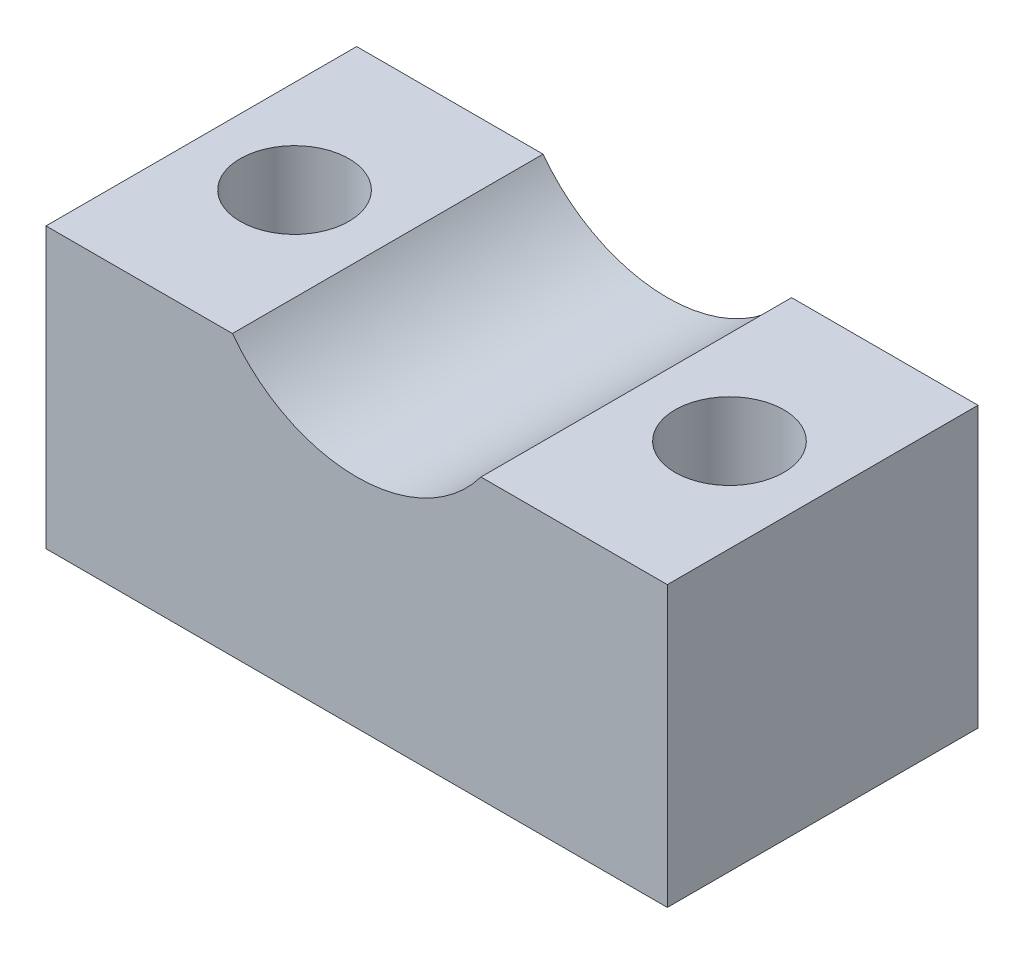
ISO-10303-21;
HEADER;
FILE_DESCRIPTION(('STEP AP214'),'2;1');
FILE_NAME('part.step','',(''),(''),'','','');
FILE_SCHEMA(('AUTOMOTIVE_DESIGN { 1 0 10303 214 1 1 1 1 }'));
ENDSEC;
DATA;
#1=APPLICATION_CONTEXT('core data for automotive mechanical design processes');
#2=APPLICATION_PROTOCOL_DEFINITION('international standard','automotive_design',2000,#1);
#3=PRODUCT_CONTEXT('',#1,'mechanical');
#4=PRODUCT('Part','Part','',(#3));
#5=PRODUCT_RELATED_PRODUCT_CATEGORY('part','',(#4));
#6=PRODUCT_DEFINITION_FORMATION('','',#4);
#7=PRODUCT_DEFINITION_CONTEXT('part definition',#1,'design');
#8=PRODUCT_DEFINITION('design','',#6,#7);
#9=PRODUCT_DEFINITION_SHAPE('','',#8);
#10=(LENGTH_UNIT() NAMED_UNIT(*) SI_UNIT(.MILLI.,.METRE.));
#11=(NAMED_UNIT(*) PLANE_ANGLE_UNIT() SI_UNIT($,.RADIAN.));
#12=(NAMED_UNIT(*) SI_UNIT($,.STERADIAN.) SOLID_ANGLE_UNIT());
#13=UNCERTAINTY_MEASURE_WITH_UNIT(LENGTH_MEASURE(1.E-05),#10,'distance_accuracy_value','');
#14=(GEOMETRIC_REPRESENTATION_CONTEXT(3) GLOBAL_UNCERTAINTY_ASSIGNED_CONTEXT((#13)) GLOBAL_UNIT_ASSIGNED_CONTEXT((#10,
#11,#12)) REPRESENTATION_CONTEXT('',''));
#15=CARTESIAN_POINT('',(0.,0.,0.));
#16=DIRECTION('',(0.,0.,1.));
#17=DIRECTION('',(1.,0.,0.));
#18=AXIS2_PLACEMENT_3D('',#15,#16,#17);
#19=CARTESIAN_POINT('',(0.,0.,10.));
#20=DIRECTION('',(1.,0.,0.));
#21=DIRECTION('',(0.,1.,0.));
#22=AXIS2_PLACEMENT_3D('',#19,#20,#21);
#23=PLANE('',#22);
#24=DIRECTION('',(0.,-1.,0.));
#25=VECTOR('',#24,1.);
#26=CARTESIAN_POINT('',(0.,0.,0.));
#27=LINE('',#26,#25);
#28=CARTESIAN_POINT('',(0.,9.,0.));
#29=VERTEX_POINT('',#28);
#30=CARTESIAN_POINT('',(0.,0.,0.));
#31=VERTEX_POINT('',#30);
#32=EDGE_CURVE('E119',#29,#31,#27,.T.);
#33=ORIENTED_EDGE('',*,*,#32,.T.);
#34=DIRECTION('',(0.,0.,-1.));
#35=VECTOR('',#34,1.);
#36=CARTESIAN_POINT('',(0.,0.,10.));
#37=LINE('',#36,#35);
#38=CARTESIAN_POINT('',(0.,0.,10.));
#39=VERTEX_POINT('',#38);
#40=EDGE_CURVE('E11',#39,#31,#37,.T.);
#41=ORIENTED_EDGE('',*,*,#40,.F.);
#42=DIRECTION('',(0.,-1.,0.));
#43=VECTOR('',#42,1.);
#44=CARTESIAN_POINT('',(0.,0.,10.));
#45=LINE('',#44,#43);
#46=CARTESIAN_POINT('',(0.,9.,10.));
#47=VERTEX_POINT('',#46);
#48=EDGE_CURVE('E130',#47,#39,#45,.T.);
#49=ORIENTED_EDGE('',*,*,#48,.F.);
#50=DIRECTION('',(0.,0.,-1.));
#51=VECTOR('',#50,1.);
#52=CARTESIAN_POINT('',(0.,9.,10.));
#53=LINE('',#52,#51);
#54=EDGE_CURVE('E115',#47,#29,#53,.T.);
#55=ORIENTED_EDGE('',*,*,#54,.T.);
#56=EDGE_LOOP('',(#33,#41,#49,#55));
#57=FACE_BOUND('',#56,.T.);
#58=ADVANCED_FACE('F35',(#57),#23,.F.);
#59=CARTESIAN_POINT('',(0.,0.,10.));
#60=DIRECTION('',(0.,1.,0.));
#61=DIRECTION('',(0.,0.,1.));
#62=AXIS2_PLACEMENT_3D('',#59,#60,#61);
#63=PLANE('',#62);
#64=CARTESIAN_POINT('',(17.,0.,5.));
#65=DIRECTION('',(0.,1.,0.));
#66=DIRECTION('',(0.,0.,1.));
#67=AXIS2_PLACEMENT_3D('',#64,#65,#66);
#68=CIRCLE('',#67,1.75);
#69=CARTESIAN_POINT('',(17.,0.,6.75));
#70=VERTEX_POINT('',#69);
#71=EDGE_CURVE('E176',#70,#70,#68,.T.);
#72=ORIENTED_EDGE('',*,*,#71,.T.);
#73=EDGE_LOOP('',(#72));
#74=FACE_BOUND('',#73,.T.);
#75=CARTESIAN_POINT('',(3.,0.,5.));
#76=DIRECTION('',(0.,1.,0.));
#77=DIRECTION('',(0.,0.,1.));
#78=AXIS2_PLACEMENT_3D('',#75,#76,#77);
#79=CIRCLE('',#78,1.75);
#80=CARTESIAN_POINT('',(3.,0.,6.75));
#81=VERTEX_POINT('',#80);
#82=EDGE_CURVE('E123',#81,#81,#79,.T.);
#83=ORIENTED_EDGE('',*,*,#82,.T.);
#84=EDGE_LOOP('',(#83));
#85=FACE_BOUND('',#84,.T.);
#86=DIRECTION('',(1.,0.,0.));
#87=VECTOR('',#86,1.);
#88=CARTESIAN_POINT('',(0.,0.,0.));
#89=LINE('',#88,#87);
#90=CARTESIAN_POINT('',(20.,0.,0.));
#91=VERTEX_POINT('',#90);
#92=EDGE_CURVE('E122',#31,#91,#89,.T.);
#93=ORIENTED_EDGE('',*,*,#92,.T.);
#94=DIRECTION('',(0.,0.,-1.));
#95=VECTOR('',#94,1.);
#96=CARTESIAN_POINT('',(20.,0.,10.));
#97=LINE('',#96,#95);
#98=CARTESIAN_POINT('',(20.,0.,10.));
#99=VERTEX_POINT('',#98);
#100=EDGE_CURVE('E43',#99,#91,#97,.T.);
#101=ORIENTED_EDGE('',*,*,#100,.F.);
#102=DIRECTION('',(1.,0.,0.));
#103=VECTOR('',#102,1.);
#104=CARTESIAN_POINT('',(0.,0.,10.));
#105=LINE('',#104,#103);
#106=EDGE_CURVE('E88',#39,#99,#105,.T.);
#107=ORIENTED_EDGE('',*,*,#106,.F.);
#108=ORIENTED_EDGE('',*,*,#40,.T.);
#109=EDGE_LOOP('',(#93,#101,#107,#108));
#110=FACE_BOUND('',#109,.T.);
#111=ADVANCED_FACE('F156',(#74,#85,#110),#63,.F.);
#112=CARTESIAN_POINT('',(20.,0.,10.));
#113=DIRECTION('',(-1.,0.,0.));
#114=DIRECTION('',(0.,0.,1.));
#115=AXIS2_PLACEMENT_3D('',#112,#113,#114);
#116=PLANE('',#115);
#117=DIRECTION('',(0.,1.,0.));
#118=VECTOR('',#117,1.);
#119=CARTESIAN_POINT('',(20.,0.,0.));
#120=LINE('',#119,#118);
#121=CARTESIAN_POINT('',(20.,9.,0.));
#122=VERTEX_POINT('',#121);
#123=EDGE_CURVE('E125',#91,#122,#120,.T.);
#124=ORIENTED_EDGE('',*,*,#123,.T.);
#125=DIRECTION('',(0.,0.,-1.));
#126=VECTOR('',#125,1.);
#127=CARTESIAN_POINT('',(20.,9.,10.));
#128=LINE('',#127,#126);
#129=CARTESIAN_POINT('',(20.,9.,10.));
#130=VERTEX_POINT('',#129);
#131=EDGE_CURVE('E110',#130,#122,#128,.T.);
#132=ORIENTED_EDGE('',*,*,#131,.F.);
#133=DIRECTION('',(0.,1.,0.));
#134=VECTOR('',#133,1.);
#135=CARTESIAN_POINT('',(20.,0.,10.));
#136=LINE('',#135,#134);
#137=EDGE_CURVE('E101',#99,#130,#136,.T.);
#138=ORIENTED_EDGE('',*,*,#137,.F.);
#139=ORIENTED_EDGE('',*,*,#100,.T.);
#140=EDGE_LOOP('',(#124,#132,#138,#139));
#141=FACE_BOUND('',#140,.T.);
#142=ADVANCED_FACE('F136',(#141),#116,.F.);
#143=CARTESIAN_POINT('',(20.,9.,10.));
#144=DIRECTION('',(0.,-1.,0.));
#145=DIRECTION('',(0.,0.,-1.));
#146=AXIS2_PLACEMENT_3D('',#143,#144,#145);
#147=PLANE('',#146);
#148=CARTESIAN_POINT('',(17.,9.,5.));
#149=DIRECTION('',(0.,1.,0.));
#150=DIRECTION('',(0.,0.,1.));
#151=AXIS2_PLACEMENT_3D('',#148,#149,#150);
#152=CIRCLE('',#151,1.75);
#153=CARTESIAN_POINT('',(17.,9.,6.75));
#154=VERTEX_POINT('',#153);
#155=EDGE_CURVE('E174',#154,#154,#152,.T.);
#156=ORIENTED_EDGE('',*,*,#155,.F.);
#157=EDGE_LOOP('',(#156));
#158=FACE_BOUND('',#157,.T.);
#159=DIRECTION('',(-1.,0.,0.));
#160=VECTOR('',#159,1.);
#161=CARTESIAN_POINT('',(20.,9.,0.));
#162=LINE('',#161,#160);
#163=CARTESIAN_POINT('',(14.,9.,0.));
#164=VERTEX_POINT('',#163);
#165=EDGE_CURVE('E109',#122,#164,#162,.T.);
#166=ORIENTED_EDGE('',*,*,#165,.T.);
#167=DIRECTION('',(0.,0.,-1.));
#168=VECTOR('',#167,1.);
#169=CARTESIAN_POINT('',(14.,9.,10.));
#170=LINE('',#169,#168);
#171=CARTESIAN_POINT('',(14.,9.,10.));
#172=VERTEX_POINT('',#171);
#173=EDGE_CURVE('E106',#172,#164,#170,.T.);
#174=ORIENTED_EDGE('',*,*,#173,.F.);
#175=DIRECTION('',(-1.,0.,0.));
#176=VECTOR('',#175,1.);
#177=CARTESIAN_POINT('',(20.,9.,10.));
#178=LINE('',#177,#176);
#179=EDGE_CURVE('E95',#130,#172,#178,.T.);
#180=ORIENTED_EDGE('',*,*,#179,.F.);
#181=ORIENTED_EDGE('',*,*,#131,.T.);
#182=EDGE_LOOP('',(#166,#174,#180,#181));
#183=FACE_BOUND('',#182,.T.);
#184=ADVANCED_FACE('F107',(#158,#183),#147,.F.);
#185=CARTESIAN_POINT('',(10.,12.,10.));
#186=DIRECTION('',(0.,0.,-1.));
#187=DIRECTION('',(-1.,0.,0.));
#188=AXIS2_PLACEMENT_3D('',#185,#186,#187);
#189=CYLINDRICAL_SURFACE('',#188,5.);
#190=CARTESIAN_POINT('',(10.,12.,0.));
#191=DIRECTION('',(0.,0.,-1.));
#192=DIRECTION('',(1.,0.,0.));
#193=AXIS2_PLACEMENT_3D('',#190,#191,#192);
#194=CIRCLE('',#193,5.);
#195=CARTESIAN_POINT('',(6.,9.,0.));
#196=VERTEX_POINT('',#195);
#197=EDGE_CURVE('E74',#164,#196,#194,.T.);
#198=ORIENTED_EDGE('',*,*,#197,.T.);
#199=DIRECTION('',(0.,0.,-1.));
#200=VECTOR('',#199,1.);
#201=CARTESIAN_POINT('',(6.,9.,10.));
#202=LINE('',#201,#200);
#203=CARTESIAN_POINT('',(6.,9.,10.));
#204=VERTEX_POINT('',#203);
#205=EDGE_CURVE('E111',#204,#196,#202,.T.);
#206=ORIENTED_EDGE('',*,*,#205,.F.);
#207=CARTESIAN_POINT('',(10.,12.,10.));
#208=DIRECTION('',(0.,0.,-1.));
#209=DIRECTION('',(1.,0.,0.));
#210=AXIS2_PLACEMENT_3D('',#207,#208,#209);
#211=CIRCLE('',#210,5.);
#212=EDGE_CURVE('E99',#172,#204,#211,.T.);
#213=ORIENTED_EDGE('',*,*,#212,.F.);
#214=ORIENTED_EDGE('',*,*,#173,.T.);
#215=EDGE_LOOP('',(#198,#206,#213,#214));
#216=FACE_BOUND('',#215,.T.);
#217=ADVANCED_FACE('F113',(#216),#189,.F.);
#218=CARTESIAN_POINT('',(0.,9.,10.));
#219=DIRECTION('',(0.,-1.,0.));
#220=DIRECTION('',(0.,0.,-1.));
#221=AXIS2_PLACEMENT_3D('',#218,#219,#220);
#222=PLANE('',#221);
#223=CARTESIAN_POINT('',(3.,9.,5.));
#224=DIRECTION('',(0.,1.,0.));
#225=DIRECTION('',(0.,0.,1.));
#226=AXIS2_PLACEMENT_3D('',#223,#224,#225);
#227=CIRCLE('',#226,1.75);
#228=CARTESIAN_POINT('',(3.,9.,6.75));
#229=VERTEX_POINT('',#228);
#230=EDGE_CURVE('E178',#229,#229,#227,.T.);
#231=ORIENTED_EDGE('',*,*,#230,.F.);
#232=EDGE_LOOP('',(#231));
#233=FACE_BOUND('',#232,.T.);
#234=DIRECTION('',(-1.,0.,0.));
#235=VECTOR('',#234,1.);
#236=CARTESIAN_POINT('',(0.,9.,0.));
#237=LINE('',#236,#235);
#238=EDGE_CURVE('E80',#196,#29,#237,.T.);
#239=ORIENTED_EDGE('',*,*,#238,.T.);
#240=ORIENTED_EDGE('',*,*,#54,.F.);
#241=DIRECTION('',(-1.,0.,0.));
#242=VECTOR('',#241,1.);
#243=CARTESIAN_POINT('',(0.,9.,10.));
#244=LINE('',#243,#242);
#245=EDGE_CURVE('E51',#204,#47,#244,.T.);
#246=ORIENTED_EDGE('',*,*,#245,.F.);
#247=ORIENTED_EDGE('',*,*,#205,.T.);
#248=EDGE_LOOP('',(#239,#240,#246,#247));
#249=FACE_BOUND('',#248,.T.);
#250=ADVANCED_FACE('F143',(#233,#249),#222,.F.);
#251=CARTESIAN_POINT('',(10.,12.,10.));
#252=DIRECTION('',(0.,0.,1.));
#253=DIRECTION('',(1.,0.,0.));
#254=AXIS2_PLACEMENT_3D('',#251,#252,#253);
#255=PLANE('',#254);
#256=ORIENTED_EDGE('',*,*,#48,.T.);
#257=ORIENTED_EDGE('',*,*,#106,.T.);
#258=ORIENTED_EDGE('',*,*,#137,.T.);
#259=ORIENTED_EDGE('',*,*,#179,.T.);
#260=ORIENTED_EDGE('',*,*,#212,.T.);
#261=ORIENTED_EDGE('',*,*,#245,.T.);
#262=EDGE_LOOP('',(#256,#257,#258,#259,#260,#261));
#263=FACE_BOUND('',#262,.T.);
#264=ADVANCED_FACE('F97',(#263),#255,.T.);
#265=CARTESIAN_POINT('',(10.,12.,0.));
#266=DIRECTION('',(0.,0.,1.));
#267=DIRECTION('',(1.,0.,0.));
#268=AXIS2_PLACEMENT_3D('',#265,#266,#267);
#269=PLANE('',#268);
#270=ORIENTED_EDGE('',*,*,#32,.F.);
#271=ORIENTED_EDGE('',*,*,#238,.F.);
#272=ORIENTED_EDGE('',*,*,#197,.F.);
#273=ORIENTED_EDGE('',*,*,#165,.F.);
#274=ORIENTED_EDGE('',*,*,#123,.F.);
#275=ORIENTED_EDGE('',*,*,#92,.F.);
#276=EDGE_LOOP('',(#270,#271,#272,#273,#274,#275));
#277=FACE_BOUND('',#276,.T.);
#278=ADVANCED_FACE('F139',(#277),#269,.F.);
#279=CARTESIAN_POINT('',(3.,0.,5.));
#280=DIRECTION('',(0.,1.,0.));
#281=DIRECTION('',(0.,0.,1.));
#282=AXIS2_PLACEMENT_3D('',#279,#280,#281);
#283=CYLINDRICAL_SURFACE('',#282,1.75);
#284=ORIENTED_EDGE('',*,*,#82,.F.);
#285=EDGE_LOOP('',(#284));
#286=FACE_BOUND('',#285,.T.);
#287=ORIENTED_EDGE('',*,*,#230,.T.);
#288=EDGE_LOOP('',(#287));
#289=FACE_BOUND('',#288,.T.);
#290=ADVANCED_FACE('F187',(#286,#289),#283,.F.);
#291=CARTESIAN_POINT('',(17.,0.,5.));
#292=DIRECTION('',(0.,1.,0.));
#293=DIRECTION('',(0.,0.,1.));
#294=AXIS2_PLACEMENT_3D('',#291,#292,#293);
#295=CYLINDRICAL_SURFACE('',#294,1.75);
#296=ORIENTED_EDGE('',*,*,#71,.F.);
#297=EDGE_LOOP('',(#296));
#298=FACE_BOUND('',#297,.T.);
#299=ORIENTED_EDGE('',*,*,#155,.T.);
#300=EDGE_LOOP('',(#299));
#301=FACE_BOUND('',#300,.T.);
#302=ADVANCED_FACE('F189',(#298,#301),#295,.F.);
#303=CLOSED_SHELL('',(#58,#111,#142,#184,#217,#250,#264,#278,#290,#302));
#304=MANIFOLD_SOLID_BREP('B2',#303);
#305=ADVANCED_BREP_SHAPE_REPRESENTATION('',(#18,#304),#14);
#306=SHAPE_DEFINITION_REPRESENTATION(#9,#305);
ENDSEC;
END-ISO-10303-21;
